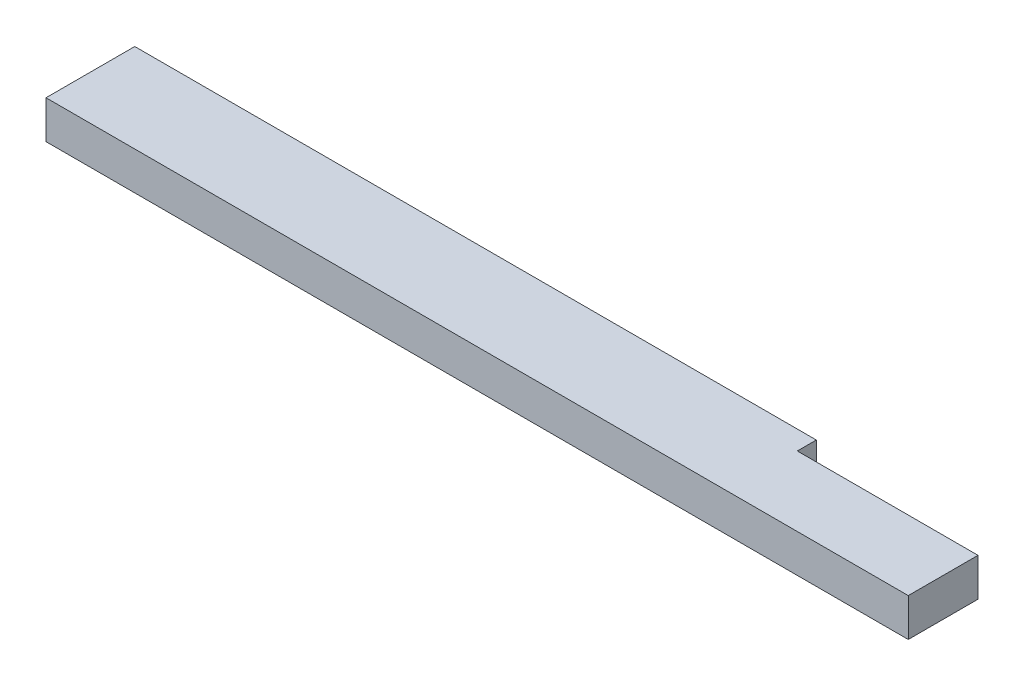
ISO-10303-21;
HEADER;
FILE_DESCRIPTION(('STEP AP214'),'2;1');
FILE_NAME('part.step','',(''),(''),'','','');
FILE_SCHEMA(('AUTOMOTIVE_DESIGN { 1 0 10303 214 1 1 1 1 }'));
ENDSEC;
DATA;
#1=APPLICATION_CONTEXT('core data for automotive mechanical design processes');
#2=APPLICATION_PROTOCOL_DEFINITION('international standard','automotive_design',2000,#1);
#3=PRODUCT_CONTEXT('',#1,'mechanical');
#4=PRODUCT('Part','Part','',(#3));
#5=PRODUCT_RELATED_PRODUCT_CATEGORY('part','',(#4));
#6=PRODUCT_DEFINITION_FORMATION('','',#4);
#7=PRODUCT_DEFINITION_CONTEXT('part definition',#1,'design');
#8=PRODUCT_DEFINITION('design','',#6,#7);
#9=PRODUCT_DEFINITION_SHAPE('','',#8);
#10=(LENGTH_UNIT() NAMED_UNIT(*) SI_UNIT(.MILLI.,.METRE.));
#11=(NAMED_UNIT(*) PLANE_ANGLE_UNIT() SI_UNIT($,.RADIAN.));
#12=(NAMED_UNIT(*) SI_UNIT($,.STERADIAN.) SOLID_ANGLE_UNIT());
#13=UNCERTAINTY_MEASURE_WITH_UNIT(LENGTH_MEASURE(1.E-05),#10,'distance_accuracy_value','');
#14=(GEOMETRIC_REPRESENTATION_CONTEXT(3) GLOBAL_UNCERTAINTY_ASSIGNED_CONTEXT((#13)) GLOBAL_UNIT_ASSIGNED_CONTEXT((#10,
#11,#12)) REPRESENTATION_CONTEXT('',''));
#15=CARTESIAN_POINT('',(0.,0.,0.));
#16=DIRECTION('',(0.,0.,1.));
#17=DIRECTION('',(1.,0.,0.));
#18=AXIS2_PLACEMENT_3D('',#15,#16,#17);
#19=CARTESIAN_POINT('',(0.,38.1,0.));
#20=DIRECTION('',(1.,0.,0.));
#21=DIRECTION('',(0.,0.,-1.));
#22=AXIS2_PLACEMENT_3D('',#19,#20,#21);
#23=PLANE('',#22);
#24=DIRECTION('',(0.,0.,1.));
#25=VECTOR('',#24,1.);
#26=CARTESIAN_POINT('',(0.,0.,0.));
#27=LINE('',#26,#25);
#28=CARTESIAN_POINT('',(0.,0.,-88.9));
#29=VERTEX_POINT('',#28);
#30=CARTESIAN_POINT('',(0.,0.,0.));
#31=VERTEX_POINT('',#30);
#32=EDGE_CURVE('E113',#29,#31,#27,.T.);
#33=ORIENTED_EDGE('',*,*,#32,.T.);
#34=DIRECTION('',(0.,-1.,0.));
#35=VECTOR('',#34,1.);
#36=CARTESIAN_POINT('',(0.,38.1,0.));
#37=LINE('',#36,#35);
#38=CARTESIAN_POINT('',(0.,38.1,0.));
#39=VERTEX_POINT('',#38);
#40=EDGE_CURVE('E11',#39,#31,#37,.T.);
#41=ORIENTED_EDGE('',*,*,#40,.F.);
#42=DIRECTION('',(0.,0.,1.));
#43=VECTOR('',#42,1.);
#44=CARTESIAN_POINT('',(0.,38.1,0.));
#45=LINE('',#44,#43);
#46=CARTESIAN_POINT('',(0.,38.1,-88.9));
#47=VERTEX_POINT('',#46);
#48=EDGE_CURVE('E114',#47,#39,#45,.T.);
#49=ORIENTED_EDGE('',*,*,#48,.F.);
#50=DIRECTION('',(0.,-1.,0.));
#51=VECTOR('',#50,1.);
#52=CARTESIAN_POINT('',(0.,38.1,-88.9));
#53=LINE('',#52,#51);
#54=EDGE_CURVE('E123',#47,#29,#53,.T.);
#55=ORIENTED_EDGE('',*,*,#54,.T.);
#56=EDGE_LOOP('',(#33,#41,#49,#55));
#57=FACE_BOUND('',#56,.T.);
#58=ADVANCED_FACE('F39',(#57),#23,.F.);
#59=CARTESIAN_POINT('',(0.,38.1,0.));
#60=DIRECTION('',(0.,0.,-1.));
#61=DIRECTION('',(-1.,0.,0.));
#62=AXIS2_PLACEMENT_3D('',#59,#60,#61);
#63=PLANE('',#62);
#64=DIRECTION('',(1.,0.,0.));
#65=VECTOR('',#64,1.);
#66=CARTESIAN_POINT('',(0.,0.,0.));
#67=LINE('',#66,#65);
#68=CARTESIAN_POINT('',(863.6,0.,0.));
#69=VERTEX_POINT('',#68);
#70=EDGE_CURVE('E119',#31,#69,#67,.T.);
#71=ORIENTED_EDGE('',*,*,#70,.T.);
#72=DIRECTION('',(0.,-1.,0.));
#73=VECTOR('',#72,1.);
#74=CARTESIAN_POINT('',(863.6,38.1,0.));
#75=LINE('',#74,#73);
#76=CARTESIAN_POINT('',(863.6,38.1,0.));
#77=VERTEX_POINT('',#76);
#78=EDGE_CURVE('E46',#77,#69,#75,.T.);
#79=ORIENTED_EDGE('',*,*,#78,.F.);
#80=DIRECTION('',(1.,0.,0.));
#81=VECTOR('',#80,1.);
#82=CARTESIAN_POINT('',(0.,38.1,0.));
#83=LINE('',#82,#81);
#84=EDGE_CURVE('E85',#39,#77,#83,.T.);
#85=ORIENTED_EDGE('',*,*,#84,.F.);
#86=ORIENTED_EDGE('',*,*,#40,.T.);
#87=EDGE_LOOP('',(#71,#79,#85,#86));
#88=FACE_BOUND('',#87,.T.);
#89=ADVANCED_FACE('F143',(#88),#63,.F.);
#90=CARTESIAN_POINT('',(863.6,38.1,0.));
#91=DIRECTION('',(-1.,0.,0.));
#92=DIRECTION('',(0.,0.,1.));
#93=AXIS2_PLACEMENT_3D('',#90,#91,#92);
#94=PLANE('',#93);
#95=DIRECTION('',(0.,0.,-1.));
#96=VECTOR('',#95,1.);
#97=CARTESIAN_POINT('',(863.6,0.,0.));
#98=LINE('',#97,#96);
#99=CARTESIAN_POINT('',(863.6,0.,-69.85));
#100=VERTEX_POINT('',#99);
#101=EDGE_CURVE('E115',#69,#100,#98,.T.);
#102=ORIENTED_EDGE('',*,*,#101,.T.);
#103=DIRECTION('',(0.,1.,0.));
#104=VECTOR('',#103,1.);
#105=CARTESIAN_POINT('',(863.6,0.,-69.85));
#106=LINE('',#105,#104);
#107=CARTESIAN_POINT('',(863.6,38.1,-69.85));
#108=VERTEX_POINT('',#107);
#109=EDGE_CURVE('E137',#100,#108,#106,.T.);
#110=ORIENTED_EDGE('',*,*,#109,.T.);
#111=DIRECTION('',(0.,0.,-1.));
#112=VECTOR('',#111,1.);
#113=CARTESIAN_POINT('',(863.6,38.1,0.));
#114=LINE('',#113,#112);
#115=EDGE_CURVE('E131',#77,#108,#114,.T.);
#116=ORIENTED_EDGE('',*,*,#115,.F.);
#117=ORIENTED_EDGE('',*,*,#78,.T.);
#118=EDGE_LOOP('',(#102,#110,#116,#117));
#119=FACE_BOUND('',#118,.T.);
#120=ADVANCED_FACE('F128',(#119),#94,.F.);
#121=CARTESIAN_POINT('',(0.,38.1,-88.9));
#122=DIRECTION('',(0.,0.,1.));
#123=DIRECTION('',(1.,0.,0.));
#124=AXIS2_PLACEMENT_3D('',#121,#122,#123);
#125=PLANE('',#124);
#126=DIRECTION('',(-1.,0.,0.));
#127=VECTOR('',#126,1.);
#128=CARTESIAN_POINT('',(0.,38.1,-88.9));
#129=LINE('',#128,#127);
#130=CARTESIAN_POINT('',(682.625,38.1,-88.9));
#131=VERTEX_POINT('',#130);
#132=EDGE_CURVE('E62',#131,#47,#129,.T.);
#133=ORIENTED_EDGE('',*,*,#132,.F.);
#134=DIRECTION('',(0.,1.,0.));
#135=VECTOR('',#134,1.);
#136=CARTESIAN_POINT('',(682.625,0.,-88.9));
#137=LINE('',#136,#135);
#138=CARTESIAN_POINT('',(682.625,0.,-88.9));
#139=VERTEX_POINT('',#138);
#140=EDGE_CURVE('E103',#139,#131,#137,.T.);
#141=ORIENTED_EDGE('',*,*,#140,.F.);
#142=DIRECTION('',(-1.,0.,0.));
#143=VECTOR('',#142,1.);
#144=CARTESIAN_POINT('',(0.,0.,-88.9));
#145=LINE('',#144,#143);
#146=EDGE_CURVE('E80',#139,#29,#145,.T.);
#147=ORIENTED_EDGE('',*,*,#146,.T.);
#148=ORIENTED_EDGE('',*,*,#54,.F.);
#149=EDGE_LOOP('',(#133,#141,#147,#148));
#150=FACE_BOUND('',#149,.T.);
#151=ADVANCED_FACE('F108',(#150),#125,.F.);
#152=CARTESIAN_POINT('',(0.,38.1,0.));
#153=DIRECTION('',(0.,-1.,0.));
#154=DIRECTION('',(0.,0.,-1.));
#155=AXIS2_PLACEMENT_3D('',#152,#153,#154);
#156=PLANE('',#155);
#157=ORIENTED_EDGE('',*,*,#115,.T.);
#158=DIRECTION('',(1.,0.,0.));
#159=VECTOR('',#158,1.);
#160=CARTESIAN_POINT('',(863.6,38.1,-69.85));
#161=LINE('',#160,#159);
#162=CARTESIAN_POINT('',(682.625,38.1,-69.85));
#163=VERTEX_POINT('',#162);
#164=EDGE_CURVE('E106',#163,#108,#161,.T.);
#165=ORIENTED_EDGE('',*,*,#164,.F.);
#166=DIRECTION('',(0.,0.,1.));
#167=VECTOR('',#166,1.);
#168=CARTESIAN_POINT('',(682.625,38.1,-88.9));
#169=LINE('',#168,#167);
#170=EDGE_CURVE('E134',#131,#163,#169,.T.);
#171=ORIENTED_EDGE('',*,*,#170,.F.);
#172=ORIENTED_EDGE('',*,*,#132,.T.);
#173=ORIENTED_EDGE('',*,*,#48,.T.);
#174=ORIENTED_EDGE('',*,*,#84,.T.);
#175=EDGE_LOOP('',(#157,#165,#171,#172,#173,#174));
#176=FACE_BOUND('',#175,.T.);
#177=ADVANCED_FACE('F147',(#176),#156,.F.);
#178=CARTESIAN_POINT('',(0.,0.,0.));
#179=DIRECTION('',(0.,-1.,0.));
#180=DIRECTION('',(0.,0.,-1.));
#181=AXIS2_PLACEMENT_3D('',#178,#179,#180);
#182=PLANE('',#181);
#183=DIRECTION('',(1.,0.,0.));
#184=VECTOR('',#183,1.);
#185=CARTESIAN_POINT('',(863.6,0.,-69.85));
#186=LINE('',#185,#184);
#187=CARTESIAN_POINT('',(682.625,0.,-69.85));
#188=VERTEX_POINT('',#187);
#189=EDGE_CURVE('E53',#188,#100,#186,.T.);
#190=ORIENTED_EDGE('',*,*,#189,.T.);
#191=ORIENTED_EDGE('',*,*,#101,.F.);
#192=ORIENTED_EDGE('',*,*,#70,.F.);
#193=ORIENTED_EDGE('',*,*,#32,.F.);
#194=ORIENTED_EDGE('',*,*,#146,.F.);
#195=DIRECTION('',(0.,0.,1.));
#196=VECTOR('',#195,1.);
#197=CARTESIAN_POINT('',(682.625,0.,-88.9));
#198=LINE('',#197,#196);
#199=EDGE_CURVE('E100',#139,#188,#198,.T.);
#200=ORIENTED_EDGE('',*,*,#199,.T.);
#201=EDGE_LOOP('',(#190,#191,#192,#193,#194,#200));
#202=FACE_BOUND('',#201,.T.);
#203=ADVANCED_FACE('F111',(#202),#182,.T.);
#204=CARTESIAN_POINT('',(863.6,0.,-69.85));
#205=DIRECTION('',(0.,0.,1.));
#206=DIRECTION('',(1.,0.,0.));
#207=AXIS2_PLACEMENT_3D('',#204,#205,#206);
#208=PLANE('',#207);
#209=ORIENTED_EDGE('',*,*,#164,.T.);
#210=ORIENTED_EDGE('',*,*,#109,.F.);
#211=ORIENTED_EDGE('',*,*,#189,.F.);
#212=DIRECTION('',(0.,1.,0.));
#213=VECTOR('',#212,1.);
#214=CARTESIAN_POINT('',(682.625,0.,-69.85));
#215=LINE('',#214,#213);
#216=EDGE_CURVE('E104',#188,#163,#215,.T.);
#217=ORIENTED_EDGE('',*,*,#216,.T.);
#218=EDGE_LOOP('',(#209,#210,#211,#217));
#219=FACE_BOUND('',#218,.T.);
#220=ADVANCED_FACE('F149',(#219),#208,.F.);
#221=CARTESIAN_POINT('',(682.625,0.,-88.9));
#222=DIRECTION('',(-1.,0.,0.));
#223=DIRECTION('',(0.,0.,1.));
#224=AXIS2_PLACEMENT_3D('',#221,#222,#223);
#225=PLANE('',#224);
#226=ORIENTED_EDGE('',*,*,#170,.T.);
#227=ORIENTED_EDGE('',*,*,#216,.F.);
#228=ORIENTED_EDGE('',*,*,#199,.F.);
#229=ORIENTED_EDGE('',*,*,#140,.T.);
#230=EDGE_LOOP('',(#226,#227,#228,#229));
#231=FACE_BOUND('',#230,.T.);
#232=ADVANCED_FACE('F102',(#231),#225,.F.);
#233=CLOSED_SHELL('',(#58,#89,#120,#151,#177,#203,#220,#232));
#234=MANIFOLD_SOLID_BREP('B2',#233);
#235=ADVANCED_BREP_SHAPE_REPRESENTATION('',(#18,#234),#14);
#236=SHAPE_DEFINITION_REPRESENTATION(#9,#235);
ENDSEC;
END-ISO-10303-21;
